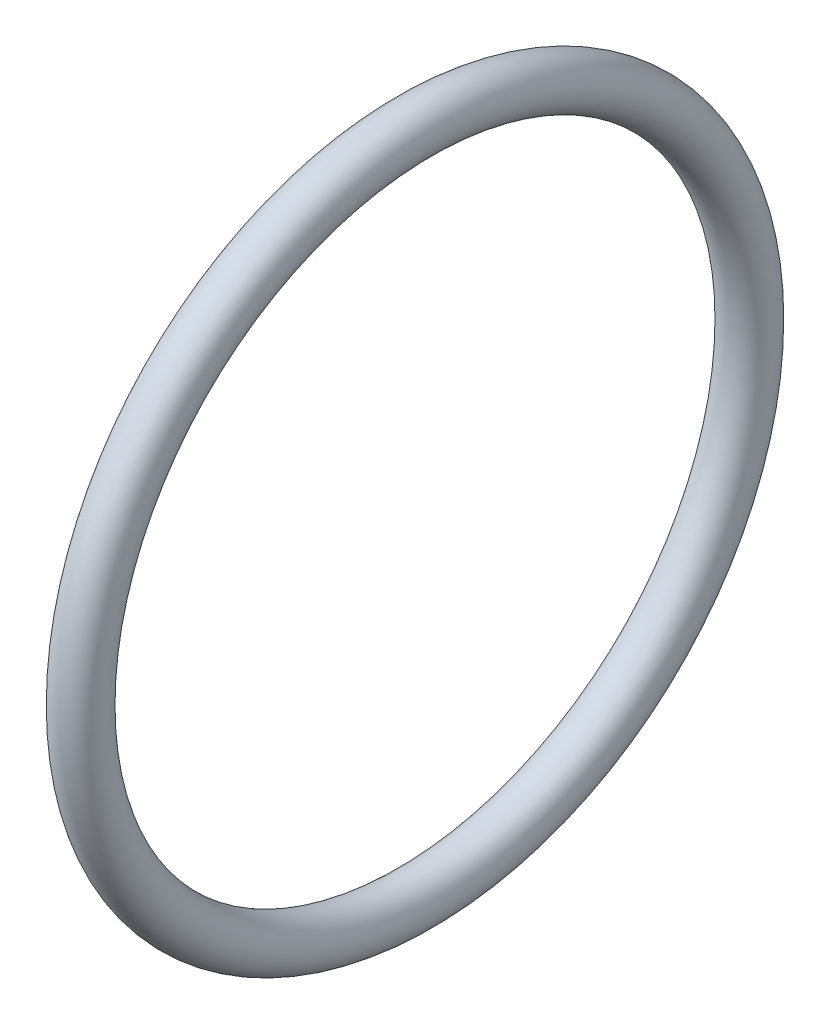
ISO-10303-21;
HEADER;
FILE_DESCRIPTION(('STEP AP214'),'2;1');
FILE_NAME('part.step','',(''),(''),'','','');
FILE_SCHEMA(('AUTOMOTIVE_DESIGN { 1 0 10303 214 1 1 1 1 }'));
ENDSEC;
DATA;
#1=APPLICATION_CONTEXT('core data for automotive mechanical design processes');
#2=APPLICATION_PROTOCOL_DEFINITION('international standard','automotive_design',2000,#1);
#3=PRODUCT_CONTEXT('',#1,'mechanical');
#4=PRODUCT('Part','Part','',(#3));
#5=PRODUCT_RELATED_PRODUCT_CATEGORY('part','',(#4));
#6=PRODUCT_DEFINITION_FORMATION('','',#4);
#7=PRODUCT_DEFINITION_CONTEXT('part definition',#1,'design');
#8=PRODUCT_DEFINITION('design','',#6,#7);
#9=PRODUCT_DEFINITION_SHAPE('','',#8);
#10=(LENGTH_UNIT() NAMED_UNIT(*) SI_UNIT(.MILLI.,.METRE.));
#11=(NAMED_UNIT(*) PLANE_ANGLE_UNIT() SI_UNIT($,.RADIAN.));
#12=(NAMED_UNIT(*) SI_UNIT($,.STERADIAN.) SOLID_ANGLE_UNIT());
#13=UNCERTAINTY_MEASURE_WITH_UNIT(LENGTH_MEASURE(1.E-05),#10,'distance_accuracy_value','');
#14=(GEOMETRIC_REPRESENTATION_CONTEXT(3) GLOBAL_UNCERTAINTY_ASSIGNED_CONTEXT((#13)) GLOBAL_UNIT_ASSIGNED_CONTEXT((#10,
#11,#12)) REPRESENTATION_CONTEXT('',''));
#15=CARTESIAN_POINT('',(0.,0.,0.));
#16=DIRECTION('',(0.,0.,1.));
#17=DIRECTION('',(1.,0.,0.));
#18=AXIS2_PLACEMENT_3D('',#15,#16,#17);
#19=CARTESIAN_POINT('',(2.54,0.,0.));
#20=DIRECTION('',(-1.,0.,0.));
#21=DIRECTION('',(0.,0.,1.));
#22=AXIS2_PLACEMENT_3D('',#19,#20,#21);
#23=TOROIDAL_SURFACE('',#22,13.97,1.016);
#24=CARTESIAN_POINT('',(2.54,0.,14.986));
#25=VERTEX_POINT('',#24);
#26=VERTEX_LOOP('',#25);
#27=FACE_BOUND('',#26,.T.);
#28=ADVANCED_FACE('F31',(#27),#23,.T.);
#29=CLOSED_SHELL('',(#28));
#30=MANIFOLD_SOLID_BREP('B2',#29);
#31=ADVANCED_BREP_SHAPE_REPRESENTATION('',(#18,#30),#14);
#32=SHAPE_DEFINITION_REPRESENTATION(#9,#31);
ENDSEC;
END-ISO-10303-21;
